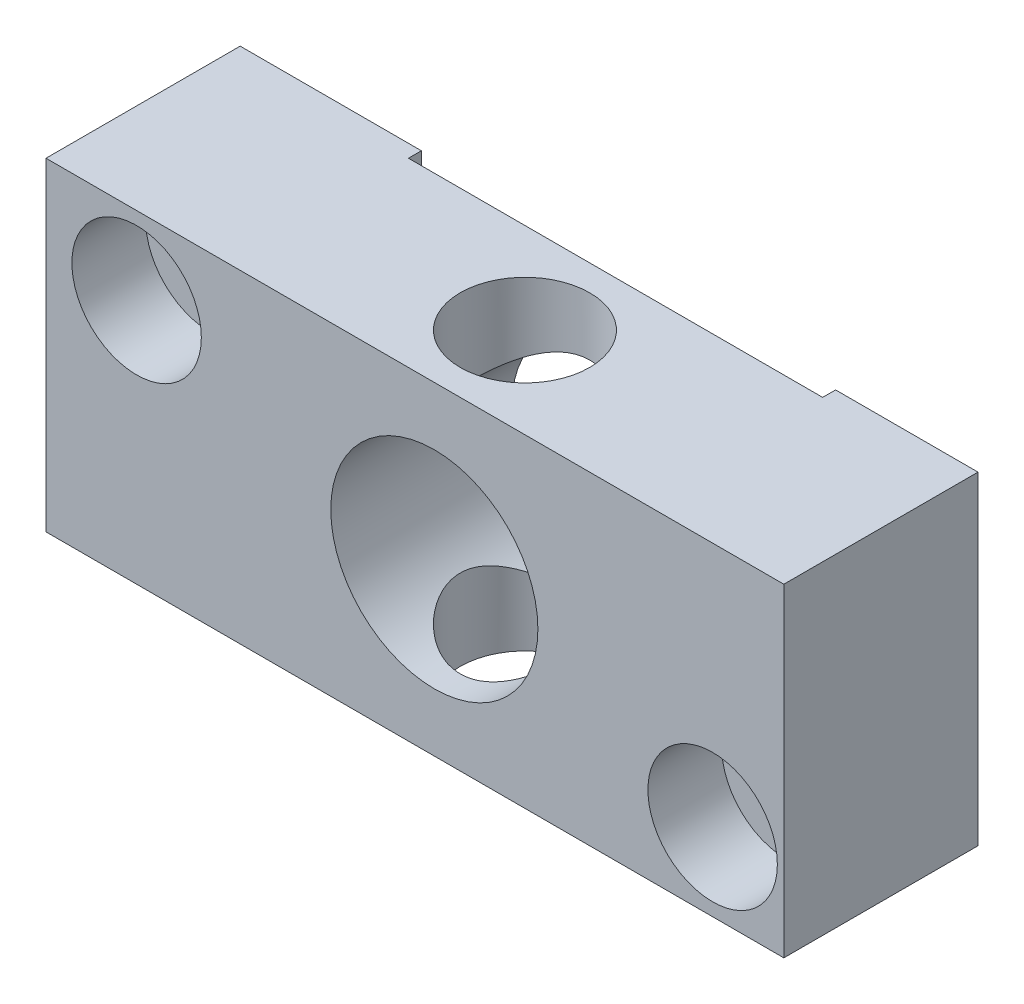
ISO-10303-21;
HEADER;
FILE_DESCRIPTION(('STEP AP214'),'2;1');
FILE_NAME('part.step','',(''),(''),'','','');
FILE_SCHEMA(('AUTOMOTIVE_DESIGN { 1 0 10303 214 1 1 1 1 }'));
ENDSEC;
DATA;
#1=APPLICATION_CONTEXT('core data for automotive mechanical design processes');
#2=APPLICATION_PROTOCOL_DEFINITION('international standard','automotive_design',2000,#1);
#3=PRODUCT_CONTEXT('',#1,'mechanical');
#4=PRODUCT('Part','Part','',(#3));
#5=PRODUCT_RELATED_PRODUCT_CATEGORY('part','',(#4));
#6=PRODUCT_DEFINITION_FORMATION('','',#4);
#7=PRODUCT_DEFINITION_CONTEXT('part definition',#1,'design');
#8=PRODUCT_DEFINITION('design','',#6,#7);
#9=PRODUCT_DEFINITION_SHAPE('','',#8);
#10=(LENGTH_UNIT() NAMED_UNIT(*) SI_UNIT(.MILLI.,.METRE.));
#11=(NAMED_UNIT(*) PLANE_ANGLE_UNIT() SI_UNIT($,.RADIAN.));
#12=(NAMED_UNIT(*) SI_UNIT($,.STERADIAN.) SOLID_ANGLE_UNIT());
#13=UNCERTAINTY_MEASURE_WITH_UNIT(LENGTH_MEASURE(1.E-05),#10,'distance_accuracy_value','');
#14=(GEOMETRIC_REPRESENTATION_CONTEXT(3) GLOBAL_UNCERTAINTY_ASSIGNED_CONTEXT((#13)) GLOBAL_UNIT_ASSIGNED_CONTEXT((#10,
#11,#12)) REPRESENTATION_CONTEXT('',''));
#15=CARTESIAN_POINT('',(0.,0.,0.));
#16=DIRECTION('',(0.,0.,1.));
#17=DIRECTION('',(1.,0.,0.));
#18=AXIS2_PLACEMENT_3D('',#15,#16,#17);
#19=CARTESIAN_POINT('',(23.,6.,-7.5));
#20=DIRECTION('',(0.,0.,1.));
#21=DIRECTION('',(1.,0.,0.));
#22=AXIS2_PLACEMENT_3D('',#19,#20,#21);
#23=CYLINDRICAL_SURFACE('',#22,2.75);
#24=CARTESIAN_POINT('',(23.,6.,-7.5));
#25=DIRECTION('',(0.,0.,1.));
#26=DIRECTION('',(1.,0.,0.));
#27=AXIS2_PLACEMENT_3D('',#24,#25,#26);
#28=CIRCLE('',#27,2.75);
#29=CARTESIAN_POINT('',(25.75,6.,-7.5));
#30=VERTEX_POINT('',#29);
#31=EDGE_CURVE('E222',#30,#30,#28,.T.);
#32=ORIENTED_EDGE('',*,*,#31,.F.);
#33=EDGE_LOOP('',(#32));
#34=FACE_BOUND('',#33,.T.);
#35=CARTESIAN_POINT('',(23.,6.,1.8));
#36=DIRECTION('',(0.,0.,1.));
#37=DIRECTION('',(1.,0.,0.));
#38=AXIS2_PLACEMENT_3D('',#35,#36,#37);
#39=CIRCLE('',#38,2.75);
#40=CARTESIAN_POINT('',(25.75,6.,1.8));
#41=VERTEX_POINT('',#40);
#42=EDGE_CURVE('E43',#41,#41,#39,.F.);
#43=ORIENTED_EDGE('',*,*,#42,.F.);
#44=EDGE_LOOP('',(#43));
#45=FACE_BOUND('',#44,.T.);
#46=ADVANCED_FACE('F39',(#34,#45),#23,.F.);
#47=CARTESIAN_POINT('',(-21.5,19.,-7.5));
#48=DIRECTION('',(0.,0.,1.));
#49=DIRECTION('',(1.,0.,0.));
#50=AXIS2_PLACEMENT_3D('',#47,#48,#49);
#51=CYLINDRICAL_SURFACE('',#50,2.75);
#52=CARTESIAN_POINT('',(-21.5,19.,-7.5));
#53=DIRECTION('',(0.,0.,1.));
#54=DIRECTION('',(1.,0.,0.));
#55=AXIS2_PLACEMENT_3D('',#52,#53,#54);
#56=CIRCLE('',#55,2.75);
#57=CARTESIAN_POINT('',(-18.75,19.,-7.5));
#58=VERTEX_POINT('',#57);
#59=EDGE_CURVE('E195',#58,#58,#56,.T.);
#60=ORIENTED_EDGE('',*,*,#59,.F.);
#61=EDGE_LOOP('',(#60));
#62=FACE_BOUND('',#61,.T.);
#63=CARTESIAN_POINT('',(-21.5,19.,1.8));
#64=DIRECTION('',(0.,0.,1.));
#65=DIRECTION('',(1.,0.,0.));
#66=AXIS2_PLACEMENT_3D('',#63,#64,#65);
#67=CIRCLE('',#66,2.75);
#68=CARTESIAN_POINT('',(-18.75,19.,1.8));
#69=VERTEX_POINT('',#68);
#70=EDGE_CURVE('E227',#69,#69,#67,.F.);
#71=ORIENTED_EDGE('',*,*,#70,.F.);
#72=EDGE_LOOP('',(#71));
#73=FACE_BOUND('',#72,.T.);
#74=ADVANCED_FACE('F209',(#62,#73),#51,.F.);
#75=CARTESIAN_POINT('',(1.5,25.,0.499999999999999));
#76=DIRECTION('',(0.,-1.,0.));
#77=DIRECTION('',(0.,0.,-1.));
#78=AXIS2_PLACEMENT_3D('',#75,#76,#77);
#79=CYLINDRICAL_SURFACE('',#78,5.);
#80=CARTESIAN_POINT('',(1.5,20.5,-4.5));
#81=CARTESIAN_POINT('',(1.37292028180585,20.4999996993204,-4.499999703158));
#82=CARTESIAN_POINT('',(1.24583402364684,20.4969652643807,-4.49514877169044));
#83=CARTESIAN_POINT('',(0.992634318601302,20.4849016334518,-4.47581254301626));
#84=CARTESIAN_POINT('',(0.86652131853697,20.4758698325204,-4.46132305932189));
#85=CARTESIAN_POINT('',(0.616120764419043,20.4520184465362,-4.4228878347618));
#86=CARTESIAN_POINT('',(0.491836036130645,20.4371907155965,-4.39892878436801));
#87=CARTESIAN_POINT('',(0.246119921414285,20.4021008328487,-4.3418697843255));
#88=CARTESIAN_POINT('',(0.124689765762799,20.3818363820478,-4.3087659675088));
#89=CARTESIAN_POINT('',(-0.11383677448202,20.3364650733764,-4.2340323987006));
#90=CARTESIAN_POINT('',(-0.230953116678229,20.3113851166448,-4.19244993505164));
#91=CARTESIAN_POINT('',(-0.460916501646031,20.2568549489875,-4.10110152475158));
#92=CARTESIAN_POINT('',(-0.573761869710929,20.2274030455926,-4.05133240807103));
#93=CARTESIAN_POINT('',(-0.904911909114094,20.1334070824144,-3.89050335799432));
#94=CARTESIAN_POINT('',(-1.11609848167961,20.0631697348111,-3.76783654975881));
#95=CARTESIAN_POINT('',(-1.53193014433839,19.9068029570722,-3.48444604696249));
#96=CARTESIAN_POINT('',(-1.73470598963289,19.8198523352832,-3.32146546344502));
#97=CARTESIAN_POINT('',(-2.11195776992338,19.6412401292643,-2.96710060830363));
#98=CARTESIAN_POINT('',(-2.28639500697958,19.5495723245412,-2.77567816902114));
#99=CARTESIAN_POINT('',(-2.53551059577151,19.4083621712102,-2.45571425020992));
#100=CARTESIAN_POINT('',(-2.62074022592499,19.3577220407582,-2.33571286902764));
#101=CARTESIAN_POINT('',(-2.78074637131475,19.258996468231,-2.08784896365527));
#102=CARTESIAN_POINT('',(-2.85552092872511,19.210911505681,-1.9599849735435));
#103=CARTESIAN_POINT('',(-2.99385262588457,19.1190767795695,-1.69711581232401));
#104=CARTESIAN_POINT('',(-3.05742717693475,19.0753203342642,-1.56212215723772));
#105=CARTESIAN_POINT('',(-3.17278116226384,18.9938515605684,-1.28537755230288));
#106=CARTESIAN_POINT('',(-3.22456056034896,18.9561392507246,-1.14362658172091));
#107=CARTESIAN_POINT('',(-3.30367778250346,18.8973773956048,-0.89186641707947));
#108=CARTESIAN_POINT('',(-3.33387146386473,18.8745432918813,-0.783163945588137));
#109=CARTESIAN_POINT('',(-3.3869893698177,18.8339131311323,-0.563080853126178));
#110=CARTESIAN_POINT('',(-3.40991524122178,18.8161159328931,-0.451700845020765));
#111=CARTESIAN_POINT('',(-3.44817199977536,18.7861900443545,-0.22702366166045));
#112=CARTESIAN_POINT('',(-3.46351189515875,18.7740546317427,-0.113728926331826));
#113=CARTESIAN_POINT('',(-3.48640391146144,18.7558765511001,0.114141290814806));
#114=CARTESIAN_POINT('',(-3.49395573327638,18.749834117073,0.228716821651515));
#115=CARTESIAN_POINT('',(-3.50115324292108,18.744076261913,0.458558653815394));
#116=CARTESIAN_POINT('',(-3.50077951510321,18.744376378463,0.573825959795357));
#117=CARTESIAN_POINT('',(-3.49208386707443,18.7513301416873,0.803905993516058));
#118=CARTESIAN_POINT('',(-3.4837590327066,18.7579861178449,0.918718539089881));
#119=CARTESIAN_POINT('',(-3.45928874246479,18.7773958444386,1.14702108197888));
#120=CARTESIAN_POINT('',(-3.44314081984502,18.7901515181911,1.26051065057156));
#121=CARTESIAN_POINT('',(-3.4032719377126,18.8212780522265,1.48538620317862));
#122=CARTESIAN_POINT('',(-3.37954784440757,18.8396512359911,1.59677129647281));
#123=CARTESIAN_POINT('',(-3.29874186577055,18.9012993406234,1.92161998429045));
#124=CARTESIAN_POINT('',(-3.23140686716691,18.9516270932374,2.13129247784869));
#125=CARTESIAN_POINT('',(-3.07160139234777,19.065824165778,2.53668208845984));
#126=CARTESIAN_POINT('',(-2.97912202607653,19.1296982734005,2.73239423873349));
#127=CARTESIAN_POINT('',(-2.75180409904384,19.2781897280685,3.14331465324919));
#128=CARTESIAN_POINT('',(-2.6122797851601,19.3644530526983,3.35533520228094));
#129=CARTESIAN_POINT('',(-2.30349790123425,19.540239090172,3.75534918374023));
#130=CARTESIAN_POINT('',(-2.13420977102789,19.6297650773476,3.94331757440197));
#131=CARTESIAN_POINT('',(-1.84462792787134,19.768252209276,4.2195685480643));
#132=CARTESIAN_POINT('',(-1.73332743959703,19.8185662821243,4.31674280120393));
#133=CARTESIAN_POINT('',(-1.50184758289934,19.9165140520612,4.50135111278461));
#134=CARTESIAN_POINT('',(-1.38167150233175,19.964148730294,4.5887887482357));
#135=CARTESIAN_POINT('',(-1.13291547069675,20.0554827758688,4.75323322008513));
#136=CARTESIAN_POINT('',(-1.00433330649266,20.099181099596,4.83023729302729));
#137=CARTESIAN_POINT('',(-0.739539435033786,20.1813840545714,4.97292528813083));
#138=CARTESIAN_POINT('',(-0.603332505410607,20.2198918877175,5.03861619614163));
#139=CARTESIAN_POINT('',(-0.331584989370082,20.2887019713349,5.15466886475308));
#140=CARTESIAN_POINT('',(-0.196397920189884,20.3193327980653,5.20566229777452));
#141=CARTESIAN_POINT('',(0.0790248722593712,20.374041131576,5.29602098961896));
#142=CARTESIAN_POINT('',(0.219257660304485,20.3981223807952,5.33539289010581));
#143=CARTESIAN_POINT('',(0.503515497131479,20.4389934527939,5.40186739840658));
#144=CARTESIAN_POINT('',(0.647537010197413,20.4557898346441,5.42898104411324));
#145=CARTESIAN_POINT('',(0.938084638292336,20.4815729924751,5.47049034997301));
#146=CARTESIAN_POINT('',(1.08461032111926,20.4905611025021,5.48488818263482));
#147=CARTESIAN_POINT('',(1.35676196081096,20.4996986702594,5.499520164093));
#148=CARTESIAN_POINT('',(1.48225859214319,20.5009629269789,5.501540864089));
#149=CARTESIAN_POINT('',(1.7329663677664,20.497589451826,5.4961427784958));
#150=CARTESIAN_POINT('',(1.85817753027276,20.4929521077216,5.48872461309248));
#151=CARTESIAN_POINT('',(2.10732783449661,20.4778900552125,5.46455622247317));
#152=CARTESIAN_POINT('',(2.23126708930008,20.4674658659401,5.44780683435154));
#153=CARTESIAN_POINT('',(2.47696969522164,20.4410830021414,5.40520930732267));
#154=CARTESIAN_POINT('',(2.59873300792335,20.425124230003,5.37936100793997));
#155=CARTESIAN_POINT('',(2.83450834578852,20.3887734464902,5.32009055280867));
#156=CARTESIAN_POINT('',(2.94863666980924,20.3685811289848,5.2870073558854));
#157=CARTESIAN_POINT('',(3.17350231741757,20.3238453296492,5.21311096735755));
#158=CARTESIAN_POINT('',(3.28423846943477,20.2993003639589,5.17229513929841));
#159=CARTESIAN_POINT('',(3.61043845304158,20.2198451952159,5.03885022306733));
#160=CARTESIAN_POINT('',(3.82007565393525,20.1590855713638,4.93517728812057));
#161=CARTESIAN_POINT('',(4.24037159603304,20.019594992457,4.6899279363721));
#162=CARTESIAN_POINT('',(4.44899750641244,19.9396690872721,4.54558186341555));
#163=CARTESIAN_POINT('',(4.84056091506499,19.7722803071676,4.22882840333277));
#164=CARTESIAN_POINT('',(5.02346945040511,19.6848091107345,4.05638984261562));
#165=CARTESIAN_POINT('',(5.38590040481163,19.4962341956962,3.65945503308015));
#166=CARTESIAN_POINT('',(5.56107692783136,19.3949947695843,3.43103560865682));
#167=CARTESIAN_POINT('',(5.87121122716532,19.2026710765472,2.9445124155777));
#168=CARTESIAN_POINT('',(6.00619684735976,19.1115798065832,2.68642937021098));
#169=CARTESIAN_POINT('',(6.20739703071134,18.9693398897321,2.20118604230814));
#170=CARTESIAN_POINT('',(6.28209607779641,18.9138210649208,1.97888427189796));
#171=CARTESIAN_POINT('',(6.37056932795046,18.8465659674355,1.63643451168062));
#172=CARTESIAN_POINT('',(6.39612834571372,18.8268205490864,1.52080987665685));
#173=CARTESIAN_POINT('',(6.43906627660446,18.7933595900355,1.287213009902));
#174=CARTESIAN_POINT('',(6.45644870968554,18.7796414548051,1.16924181118659));
#175=CARTESIAN_POINT('',(6.48283345322303,18.7587264656777,0.931062976531055));
#176=CARTESIAN_POINT('',(6.49178464992502,18.7515693946567,0.81084614919437));
#177=CARTESIAN_POINT('',(6.50096567028373,18.7442275405776,0.569865077298083));
#178=CARTESIAN_POINT('',(6.50119553239924,18.7440427267736,0.449100835154787));
#179=CARTESIAN_POINT('',(6.49292458618068,18.7506586724771,0.208024474188881));
#180=CARTESIAN_POINT('',(6.48442112542226,18.7574615542391,0.0877125038687355));
#181=CARTESIAN_POINT('',(6.45884706925013,18.777745568762,-0.15139366298223));
#182=CARTESIAN_POINT('',(6.44177659470705,18.7912266073017,-0.27018788090253));
#183=CARTESIAN_POINT('',(6.38153513763474,18.8382277398026,-0.603971389978071));
#184=CARTESIAN_POINT('',(6.32847742875035,18.8790757644623,-0.816237760025109));
#185=CARTESIAN_POINT('',(6.19670428935884,18.9766977700412,-1.228579701154));
#186=CARTESIAN_POINT('',(6.11797815957074,19.0334783907125,-1.42865014730156));
#187=CARTESIAN_POINT('',(5.92410573147435,19.166557931333,-1.84237556307302));
#188=CARTESIAN_POINT('',(5.80533683658203,19.2444924914292,-2.05380395596853));
#189=CARTESIAN_POINT('',(5.54000963034607,19.4067049823514,-2.45575070468091));
#190=CARTESIAN_POINT('',(5.39342885237777,19.4909880080871,-2.64625195760183));
#191=CARTESIAN_POINT('',(5.04264024371938,19.676089947826,-3.0400839692072));
#192=CARTESIAN_POINT('',(4.83276887019885,19.7768764036445,-3.23847789009049));
#193=CARTESIAN_POINT('',(4.49268031590093,19.920183590463,-3.50810023016021));
#194=CARTESIAN_POINT('',(4.37498419390475,19.9666796252241,-3.59337831825354));
#195=CARTESIAN_POINT('',(4.13162062416604,20.0558801905472,-3.75391486002553));
#196=CARTESIAN_POINT('',(4.00595739502895,20.0985866993974,-3.82917855200336));
#197=CARTESIAN_POINT('',(3.74695585117552,20.1791688889058,-3.96910627052635));
#198=CARTESIAN_POINT('',(3.61359966396132,20.2170326040972,-4.03374415122623));
#199=CARTESIAN_POINT('',(3.34039127350629,20.2867074506604,-4.15135006079646));
#200=CARTESIAN_POINT('',(3.20054287903652,20.318522076379,-4.20432482984781));
#201=CARTESIAN_POINT('',(2.91574969186899,20.3750664478824,-4.29771288731285));
#202=CARTESIAN_POINT('',(2.7708198159225,20.3998152526367,-4.33815999270725));
#203=CARTESIAN_POINT('',(2.47691245346488,20.4415135957936,-4.4059510328588));
#204=CARTESIAN_POINT('',(2.32793803832141,20.4584688862218,-4.43330463193524));
#205=CARTESIAN_POINT('',(2.0657080346281,20.4807660577289,-4.46918150103186));
#206=CARTESIAN_POINT('',(1.95301204396112,20.4879654221781,-4.48072550400174));
#207=CARTESIAN_POINT('',(1.72687913634895,20.4975826754943,-4.49613512360569));
#208=CARTESIAN_POINT('',(1.61344217398009,20.5000002684122,-4.50000026498644));
#209=CARTESIAN_POINT('',(1.5,20.5,-4.5));
#210=B_SPLINE_CURVE_WITH_KNOTS('',3,(#80,#81,#82,#83,#84,#85,#86,#87,#88,#89,#90,#91,#92,#93,
#94,#95,#96,#97,#98,#99,#100,#101,#102,#103,#104,#105,#106,#107,#108,#109,#110,#111,#112,#113,
#114,#115,#116,#117,#118,#119,#120,#121,#122,#123,#124,#125,#126,#127,#128,#129,#130,#131,#132,
#133,#134,#135,#136,#137,#138,#139,#140,#141,#142,#143,#144,#145,#146,#147,#148,#149,#150,#151,
#152,#153,#154,#155,#156,#157,#158,#159,#160,#161,#162,#163,#164,#165,#166,#167,#168,#169,#170,
#171,#172,#173,#174,#175,#176,#177,#178,#179,#180,#181,#182,#183,#184,#185,#186,#187,#188,#189,
#190,#191,#192,#193,#194,#195,#196,#197,#198,#199,#200,#201,#202,#203,#204,#205,#206,#207,#208,
#209),.UNSPECIFIED.,.T.,.F.,(4,2,2,2,2,2,2,2,2,2,2,2,2,2,2,2,2,2,2,2,2,2,2,2,2,2,2,2,2,2,2,2,2,
2,2,2,2,2,2,2,2,2,2,2,2,2,2,2,2,2,2,2,2,2,2,2,2,2,2,2,2,2,2,2,4),(0.,0.381122813878229,
0.762411275945245,1.14423755771083,1.52622555522555,1.90613865065076,2.2861992035346,
3.04547146930923,3.86537873527685,4.68639638614618,5.15288943324734,5.61946971957746,
6.08531814323784,6.55116799634915,6.89615022205285,7.24105422230075,7.58554766475416,
7.9300543371358,8.27540506342305,8.62088241265912,8.96646876744119,9.31219825544432,
9.98712845371039,10.6622975916544,11.463592889512,12.2657157783383,12.7334704505957,
13.2010527095967,13.6687585723722,14.1361745843372,14.5786070973028,15.0207862699487,
15.4625664873666,15.9042712116065,16.280349331717,16.6564027426817,17.0324224237136,
17.4084487368524,17.7696430642803,18.1309607639224,18.8530325398091,19.6479898222925,
20.4438353357779,21.355208937219,22.2659496705469,22.9857781952855,23.3455439181714,
23.705154622762,24.0669316687913,24.4287071194786,24.7905924786018,25.1524727320855,
25.8172983911075,26.482401522191,27.2437925511324,28.0058012758041,28.9187931910577,
29.3761295657642,29.8332257699805,30.2914303932663,30.7493695182481,31.2060614935589,
31.6624158626754,32.0026174741983,32.3428401405226),.UNSPECIFIED.);
#211=CARTESIAN_POINT('',(1.5,20.5,-4.5));
#212=VERTEX_POINT('',#211);
#213=EDGE_CURVE('E194',#212,#212,#210,.T.);
#214=ORIENTED_EDGE('',*,*,#213,.F.);
#215=EDGE_LOOP('',(#214));
#216=FACE_BOUND('',#215,.T.);
#217=CARTESIAN_POINT('',(1.5,25.,0.499999999999999));
#218=DIRECTION('',(0.,1.,0.));
#219=DIRECTION('',(0.,0.,1.));
#220=AXIS2_PLACEMENT_3D('',#217,#218,#219);
#221=CIRCLE('',#220,5.);
#222=CARTESIAN_POINT('',(1.5,25.,5.5));
#223=VERTEX_POINT('',#222);
#224=EDGE_CURVE('E149',#223,#223,#221,.T.);
#225=ORIENTED_EDGE('',*,*,#224,.T.);
#226=EDGE_LOOP('',(#225));
#227=FACE_BOUND('',#226,.T.);
#228=ADVANCED_FACE('F217',(#216,#227),#79,.F.);
#229=CARTESIAN_POINT('',(0.,25.,0.));
#230=DIRECTION('',(0.,1.,0.));
#231=DIRECTION('',(0.,0.,1.));
#232=AXIS2_PLACEMENT_3D('',#229,#230,#231);
#233=PLANE('',#232);
#234=DIRECTION('',(-1.,0.,0.));
#235=VECTOR('',#234,1.);
#236=CARTESIAN_POINT('',(17.5,25.,-7.5));
#237=LINE('',#236,#235);
#238=CARTESIAN_POINT('',(28.5,25.,-7.5));
#239=VERTEX_POINT('',#238);
#240=CARTESIAN_POINT('',(17.5,25.,-7.5));
#241=VERTEX_POINT('',#240);
#242=EDGE_CURVE('E167',#239,#241,#237,.T.);
#243=ORIENTED_EDGE('',*,*,#242,.T.);
#244=DIRECTION('',(0.,0.,1.));
#245=VECTOR('',#244,1.);
#246=CARTESIAN_POINT('',(17.5,25.,-6.5));
#247=LINE('',#246,#245);
#248=CARTESIAN_POINT('',(17.5,25.,-6.5));
#249=VERTEX_POINT('',#248);
#250=EDGE_CURVE('E102',#241,#249,#247,.T.);
#251=ORIENTED_EDGE('',*,*,#250,.T.);
#252=DIRECTION('',(-1.,0.,0.));
#253=VECTOR('',#252,1.);
#254=CARTESIAN_POINT('',(-14.5,25.,-6.5));
#255=LINE('',#254,#253);
#256=CARTESIAN_POINT('',(-14.5,25.,-6.5));
#257=VERTEX_POINT('',#256);
#258=EDGE_CURVE('E275',#249,#257,#255,.T.);
#259=ORIENTED_EDGE('',*,*,#258,.T.);
#260=DIRECTION('',(0.,0.,-1.));
#261=VECTOR('',#260,1.);
#262=CARTESIAN_POINT('',(-14.5,25.,-7.5));
#263=LINE('',#262,#261);
#264=CARTESIAN_POINT('',(-14.5,25.,-7.5));
#265=VERTEX_POINT('',#264);
#266=EDGE_CURVE('E278',#257,#265,#263,.T.);
#267=ORIENTED_EDGE('',*,*,#266,.T.);
#268=DIRECTION('',(-1.,0.,0.));
#269=VECTOR('',#268,1.);
#270=CARTESIAN_POINT('',(-28.5,25.,-7.5));
#271=LINE('',#270,#269);
#272=CARTESIAN_POINT('',(-28.5,25.,-7.5));
#273=VERTEX_POINT('',#272);
#274=EDGE_CURVE('E122',#265,#273,#271,.T.);
#275=ORIENTED_EDGE('',*,*,#274,.T.);
#276=DIRECTION('',(0.,0.,1.));
#277=VECTOR('',#276,1.);
#278=CARTESIAN_POINT('',(-28.5,25.,7.5));
#279=LINE('',#278,#277);
#280=CARTESIAN_POINT('',(-28.5,25.,7.5));
#281=VERTEX_POINT('',#280);
#282=EDGE_CURVE('E115',#273,#281,#279,.T.);
#283=ORIENTED_EDGE('',*,*,#282,.T.);
#284=DIRECTION('',(1.,0.,0.));
#285=VECTOR('',#284,1.);
#286=CARTESIAN_POINT('',(-28.5,25.,7.5));
#287=LINE('',#286,#285);
#288=CARTESIAN_POINT('',(28.5,25.,7.5));
#289=VERTEX_POINT('',#288);
#290=EDGE_CURVE('E120',#281,#289,#287,.T.);
#291=ORIENTED_EDGE('',*,*,#290,.T.);
#292=DIRECTION('',(0.,0.,-1.));
#293=VECTOR('',#292,1.);
#294=CARTESIAN_POINT('',(28.5,25.,7.5));
#295=LINE('',#294,#293);
#296=EDGE_CURVE('E59',#289,#239,#295,.T.);
#297=ORIENTED_EDGE('',*,*,#296,.T.);
#298=EDGE_LOOP('',(#243,#251,#259,#267,#275,#283,#291,#297));
#299=FACE_BOUND('',#298,.T.);
#300=ORIENTED_EDGE('',*,*,#224,.F.);
#301=EDGE_LOOP('',(#300));
#302=FACE_BOUND('',#301,.T.);
#303=ADVANCED_FACE('F117',(#299,#302),#233,.T.);
#304=CARTESIAN_POINT('',(0.,0.,0.));
#305=DIRECTION('',(0.,1.,0.));
#306=DIRECTION('',(0.,0.,1.));
#307=AXIS2_PLACEMENT_3D('',#304,#305,#306);
#308=PLANE('',#307);
#309=DIRECTION('',(-1.,0.,0.));
#310=VECTOR('',#309,1.);
#311=CARTESIAN_POINT('',(17.5,0.,-7.5));
#312=LINE('',#311,#310);
#313=CARTESIAN_POINT('',(28.5,0.,-7.5));
#314=VERTEX_POINT('',#313);
#315=CARTESIAN_POINT('',(17.5,0.,-7.5));
#316=VERTEX_POINT('',#315);
#317=EDGE_CURVE('E144',#314,#316,#312,.T.);
#318=ORIENTED_EDGE('',*,*,#317,.F.);
#319=DIRECTION('',(0.,0.,-1.));
#320=VECTOR('',#319,1.);
#321=CARTESIAN_POINT('',(28.5,0.,7.5));
#322=LINE('',#321,#320);
#323=CARTESIAN_POINT('',(28.5,0.,7.5));
#324=VERTEX_POINT('',#323);
#325=EDGE_CURVE('E94',#324,#314,#322,.T.);
#326=ORIENTED_EDGE('',*,*,#325,.F.);
#327=DIRECTION('',(1.,0.,0.));
#328=VECTOR('',#327,1.);
#329=CARTESIAN_POINT('',(-28.5,0.,7.5));
#330=LINE('',#329,#328);
#331=CARTESIAN_POINT('',(-28.5,0.,7.5));
#332=VERTEX_POINT('',#331);
#333=EDGE_CURVE('E88',#332,#324,#330,.T.);
#334=ORIENTED_EDGE('',*,*,#333,.F.);
#335=DIRECTION('',(0.,0.,1.));
#336=VECTOR('',#335,1.);
#337=CARTESIAN_POINT('',(-28.5,0.,7.5));
#338=LINE('',#337,#336);
#339=CARTESIAN_POINT('',(-28.5,0.,-7.5));
#340=VERTEX_POINT('',#339);
#341=EDGE_CURVE('E131',#340,#332,#338,.T.);
#342=ORIENTED_EDGE('',*,*,#341,.F.);
#343=DIRECTION('',(-1.,0.,0.));
#344=VECTOR('',#343,1.);
#345=CARTESIAN_POINT('',(-28.5,0.,-7.5));
#346=LINE('',#345,#344);
#347=CARTESIAN_POINT('',(-14.5,0.,-7.5));
#348=VERTEX_POINT('',#347);
#349=EDGE_CURVE('E158',#348,#340,#346,.T.);
#350=ORIENTED_EDGE('',*,*,#349,.F.);
#351=DIRECTION('',(0.,0.,-1.));
#352=VECTOR('',#351,1.);
#353=CARTESIAN_POINT('',(-14.5,0.,-7.5));
#354=LINE('',#353,#352);
#355=CARTESIAN_POINT('',(-14.5,0.,-6.5));
#356=VERTEX_POINT('',#355);
#357=EDGE_CURVE('E155',#356,#348,#354,.T.);
#358=ORIENTED_EDGE('',*,*,#357,.F.);
#359=DIRECTION('',(-1.,0.,0.));
#360=VECTOR('',#359,1.);
#361=CARTESIAN_POINT('',(-14.5,0.,-6.5));
#362=LINE('',#361,#360);
#363=CARTESIAN_POINT('',(17.5,0.,-6.5));
#364=VERTEX_POINT('',#363);
#365=EDGE_CURVE('E152',#364,#356,#362,.T.);
#366=ORIENTED_EDGE('',*,*,#365,.F.);
#367=DIRECTION('',(0.,0.,1.));
#368=VECTOR('',#367,1.);
#369=CARTESIAN_POINT('',(17.5,0.,-6.5));
#370=LINE('',#369,#368);
#371=EDGE_CURVE('E148',#316,#364,#370,.T.);
#372=ORIENTED_EDGE('',*,*,#371,.F.);
#373=EDGE_LOOP('',(#318,#326,#334,#342,#350,#358,#366,#372));
#374=FACE_BOUND('',#373,.T.);
#375=CARTESIAN_POINT('',(1.5,0.,0.499999999999999));
#376=DIRECTION('',(0.,1.,0.));
#377=DIRECTION('',(0.,0.,1.));
#378=AXIS2_PLACEMENT_3D('',#375,#376,#377);
#379=CIRCLE('',#378,5.);
#380=CARTESIAN_POINT('',(1.5,0.,5.5));
#381=VERTEX_POINT('',#380);
#382=EDGE_CURVE('E264',#381,#381,#379,.T.);
#383=ORIENTED_EDGE('',*,*,#382,.T.);
#384=EDGE_LOOP('',(#383));
#385=FACE_BOUND('',#384,.T.);
#386=ADVANCED_FACE('F291',(#374,#385),#308,.F.);
#387=CARTESIAN_POINT('',(17.5,25.,-7.5));
#388=DIRECTION('',(0.,0.,1.));
#389=DIRECTION('',(1.,0.,0.));
#390=AXIS2_PLACEMENT_3D('',#387,#388,#389);
#391=PLANE('',#390);
#392=ORIENTED_EDGE('',*,*,#31,.T.);
#393=EDGE_LOOP('',(#392));
#394=FACE_BOUND('',#393,.T.);
#395=ORIENTED_EDGE('',*,*,#317,.T.);
#396=DIRECTION('',(0.,-1.,0.));
#397=VECTOR('',#396,1.);
#398=CARTESIAN_POINT('',(17.5,25.,-7.5));
#399=LINE('',#398,#397);
#400=EDGE_CURVE('E11',#241,#316,#399,.T.);
#401=ORIENTED_EDGE('',*,*,#400,.F.);
#402=ORIENTED_EDGE('',*,*,#242,.F.);
#403=DIRECTION('',(0.,-1.,0.));
#404=VECTOR('',#403,1.);
#405=CARTESIAN_POINT('',(28.5,25.,-7.5));
#406=LINE('',#405,#404);
#407=EDGE_CURVE('E140',#239,#314,#406,.T.);
#408=ORIENTED_EDGE('',*,*,#407,.T.);
#409=EDGE_LOOP('',(#395,#401,#402,#408));
#410=FACE_BOUND('',#409,.T.);
#411=ADVANCED_FACE('F41',(#394,#410),#391,.F.);
#412=CARTESIAN_POINT('',(17.5,25.,-6.5));
#413=DIRECTION('',(1.,0.,0.));
#414=DIRECTION('',(0.,0.,-1.));
#415=AXIS2_PLACEMENT_3D('',#412,#413,#414);
#416=PLANE('',#415);
#417=ORIENTED_EDGE('',*,*,#371,.T.);
#418=DIRECTION('',(0.,-1.,0.));
#419=VECTOR('',#418,1.);
#420=CARTESIAN_POINT('',(17.5,25.,-6.5));
#421=LINE('',#420,#419);
#422=EDGE_CURVE('E50',#249,#364,#421,.T.);
#423=ORIENTED_EDGE('',*,*,#422,.F.);
#424=ORIENTED_EDGE('',*,*,#250,.F.);
#425=ORIENTED_EDGE('',*,*,#400,.T.);
#426=EDGE_LOOP('',(#417,#423,#424,#425));
#427=FACE_BOUND('',#426,.T.);
#428=ADVANCED_FACE('F316',(#427),#416,.F.);
#429=CARTESIAN_POINT('',(-14.5,25.,-6.5));
#430=DIRECTION('',(0.,0.,1.));
#431=DIRECTION('',(1.,0.,0.));
#432=AXIS2_PLACEMENT_3D('',#429,#430,#431);
#433=PLANE('',#432);
#434=CARTESIAN_POINT('',(1.5,12.5,-6.5));
#435=DIRECTION('',(0.,0.,1.));
#436=DIRECTION('',(1.,0.,0.));
#437=AXIS2_PLACEMENT_3D('',#434,#435,#436);
#438=CIRCLE('',#437,8.);
#439=CARTESIAN_POINT('',(9.5,12.5,-6.5));
#440=VERTEX_POINT('',#439);
#441=EDGE_CURVE('E260',#440,#440,#438,.T.);
#442=ORIENTED_EDGE('',*,*,#441,.T.);
#443=EDGE_LOOP('',(#442));
#444=FACE_BOUND('',#443,.T.);
#445=ORIENTED_EDGE('',*,*,#365,.T.);
#446=DIRECTION('',(0.,-1.,0.));
#447=VECTOR('',#446,1.);
#448=CARTESIAN_POINT('',(-14.5,25.,-6.5));
#449=LINE('',#448,#447);
#450=EDGE_CURVE('E178',#257,#356,#449,.T.);
#451=ORIENTED_EDGE('',*,*,#450,.F.);
#452=ORIENTED_EDGE('',*,*,#258,.F.);
#453=ORIENTED_EDGE('',*,*,#422,.T.);
#454=EDGE_LOOP('',(#445,#451,#452,#453));
#455=FACE_BOUND('',#454,.T.);
#456=ADVANCED_FACE('F313',(#444,#455),#433,.F.);
#457=CARTESIAN_POINT('',(-14.5,25.,-7.5));
#458=DIRECTION('',(-1.,0.,0.));
#459=DIRECTION('',(0.,0.,1.));
#460=AXIS2_PLACEMENT_3D('',#457,#458,#459);
#461=PLANE('',#460);
#462=ORIENTED_EDGE('',*,*,#357,.T.);
#463=DIRECTION('',(0.,-1.,0.));
#464=VECTOR('',#463,1.);
#465=CARTESIAN_POINT('',(-14.5,25.,-7.5));
#466=LINE('',#465,#464);
#467=EDGE_CURVE('E174',#265,#348,#466,.T.);
#468=ORIENTED_EDGE('',*,*,#467,.F.);
#469=ORIENTED_EDGE('',*,*,#266,.F.);
#470=ORIENTED_EDGE('',*,*,#450,.T.);
#471=EDGE_LOOP('',(#462,#468,#469,#470));
#472=FACE_BOUND('',#471,.T.);
#473=ADVANCED_FACE('F309',(#472),#461,.F.);
#474=CARTESIAN_POINT('',(-28.5,25.,-7.5));
#475=DIRECTION('',(0.,0.,1.));
#476=DIRECTION('',(1.,0.,0.));
#477=AXIS2_PLACEMENT_3D('',#474,#475,#476);
#478=PLANE('',#477);
#479=ORIENTED_EDGE('',*,*,#59,.T.);
#480=EDGE_LOOP('',(#479));
#481=FACE_BOUND('',#480,.T.);
#482=ORIENTED_EDGE('',*,*,#349,.T.);
#483=DIRECTION('',(0.,-1.,0.));
#484=VECTOR('',#483,1.);
#485=CARTESIAN_POINT('',(-28.5,25.,-7.5));
#486=LINE('',#485,#484);
#487=EDGE_CURVE('E133',#273,#340,#486,.T.);
#488=ORIENTED_EDGE('',*,*,#487,.F.);
#489=ORIENTED_EDGE('',*,*,#274,.F.);
#490=ORIENTED_EDGE('',*,*,#467,.T.);
#491=EDGE_LOOP('',(#482,#488,#489,#490));
#492=FACE_BOUND('',#491,.T.);
#493=ADVANCED_FACE('F306',(#481,#492),#478,.F.);
#494=CARTESIAN_POINT('',(-28.5,25.,7.5));
#495=DIRECTION('',(1.,0.,0.));
#496=DIRECTION('',(0.,0.,-1.));
#497=AXIS2_PLACEMENT_3D('',#494,#495,#496);
#498=PLANE('',#497);
#499=ORIENTED_EDGE('',*,*,#341,.T.);
#500=DIRECTION('',(0.,-1.,0.));
#501=VECTOR('',#500,1.);
#502=CARTESIAN_POINT('',(-28.5,25.,7.5));
#503=LINE('',#502,#501);
#504=EDGE_CURVE('E128',#281,#332,#503,.T.);
#505=ORIENTED_EDGE('',*,*,#504,.F.);
#506=ORIENTED_EDGE('',*,*,#282,.F.);
#507=ORIENTED_EDGE('',*,*,#487,.T.);
#508=EDGE_LOOP('',(#499,#505,#506,#507));
#509=FACE_BOUND('',#508,.T.);
#510=ADVANCED_FACE('F129',(#509),#498,.F.);
#511=CARTESIAN_POINT('',(-28.5,25.,7.5));
#512=DIRECTION('',(0.,0.,-1.));
#513=DIRECTION('',(-1.,0.,0.));
#514=AXIS2_PLACEMENT_3D('',#511,#512,#513);
#515=PLANE('',#514);
#516=CARTESIAN_POINT('',(-21.5,19.,7.5));
#517=DIRECTION('',(0.,0.,1.));
#518=DIRECTION('',(1.,0.,0.));
#519=AXIS2_PLACEMENT_3D('',#516,#517,#518);
#520=CIRCLE('',#519,5.);
#521=CARTESIAN_POINT('',(-16.5,19.,7.5));
#522=VERTEX_POINT('',#521);
#523=EDGE_CURVE('E238',#522,#522,#520,.T.);
#524=ORIENTED_EDGE('',*,*,#523,.F.);
#525=EDGE_LOOP('',(#524));
#526=FACE_BOUND('',#525,.T.);
#527=CARTESIAN_POINT('',(23.,6.,7.5));
#528=DIRECTION('',(0.,0.,1.));
#529=DIRECTION('',(1.,0.,0.));
#530=AXIS2_PLACEMENT_3D('',#527,#528,#529);
#531=CIRCLE('',#530,5.);
#532=CARTESIAN_POINT('',(28.,6.,7.5));
#533=VERTEX_POINT('',#532);
#534=EDGE_CURVE('E250',#533,#533,#531,.T.);
#535=ORIENTED_EDGE('',*,*,#534,.F.);
#536=EDGE_LOOP('',(#535));
#537=FACE_BOUND('',#536,.T.);
#538=CARTESIAN_POINT('',(1.5,12.5,7.5));
#539=DIRECTION('',(0.,0.,1.));
#540=DIRECTION('',(1.,0.,0.));
#541=AXIS2_PLACEMENT_3D('',#538,#539,#540);
#542=CIRCLE('',#541,8.);
#543=CARTESIAN_POINT('',(9.5,12.5,7.5));
#544=VERTEX_POINT('',#543);
#545=EDGE_CURVE('E230',#544,#544,#542,.T.);
#546=ORIENTED_EDGE('',*,*,#545,.F.);
#547=EDGE_LOOP('',(#546));
#548=FACE_BOUND('',#547,.T.);
#549=ORIENTED_EDGE('',*,*,#333,.T.);
#550=DIRECTION('',(0.,-1.,0.));
#551=VECTOR('',#550,1.);
#552=CARTESIAN_POINT('',(28.5,25.,7.5));
#553=LINE('',#552,#551);
#554=EDGE_CURVE('E134',#289,#324,#553,.T.);
#555=ORIENTED_EDGE('',*,*,#554,.F.);
#556=ORIENTED_EDGE('',*,*,#290,.F.);
#557=ORIENTED_EDGE('',*,*,#504,.T.);
#558=EDGE_LOOP('',(#549,#555,#556,#557));
#559=FACE_BOUND('',#558,.T.);
#560=ADVANCED_FACE('F136',(#526,#537,#548,#559),#515,.F.);
#561=CARTESIAN_POINT('',(28.5,25.,7.5));
#562=DIRECTION('',(-1.,0.,0.));
#563=DIRECTION('',(0.,0.,1.));
#564=AXIS2_PLACEMENT_3D('',#561,#562,#563);
#565=PLANE('',#564);
#566=ORIENTED_EDGE('',*,*,#325,.T.);
#567=ORIENTED_EDGE('',*,*,#407,.F.);
#568=ORIENTED_EDGE('',*,*,#296,.F.);
#569=ORIENTED_EDGE('',*,*,#554,.T.);
#570=EDGE_LOOP('',(#566,#567,#568,#569));
#571=FACE_BOUND('',#570,.T.);
#572=ADVANCED_FACE('F298',(#571),#565,.F.);
#573=CARTESIAN_POINT('',(1.5,4.5,-4.5));
#574=CARTESIAN_POINT('',(1.62707971819414,4.50000030067962,-4.499999703158));
#575=CARTESIAN_POINT('',(1.75416597635316,4.50303473561928,-4.49514877169044));
#576=CARTESIAN_POINT('',(2.00736568139869,4.51509836654825,-4.47581254301626));
#577=CARTESIAN_POINT('',(2.13347868146303,4.52413016747961,-4.46132305932189));
#578=CARTESIAN_POINT('',(2.38387923558095,4.54798155346382,-4.4228878347618));
#579=CARTESIAN_POINT('',(2.50816396386935,4.56280928440354,-4.39892878436801));
#580=CARTESIAN_POINT('',(2.75388007858571,4.59789916715132,-4.3418697843255));
#581=CARTESIAN_POINT('',(2.8753102342372,4.61816361795216,-4.3087659675088));
#582=CARTESIAN_POINT('',(3.11383677448202,4.66353492662364,-4.2340323987006));
#583=CARTESIAN_POINT('',(3.23095311667823,4.68861488335517,-4.19244993505164));
#584=CARTESIAN_POINT('',(3.46091650164603,4.74314505101251,-4.10110152475158));
#585=CARTESIAN_POINT('',(3.57376186971092,4.77259695440739,-4.05133240807103));
#586=CARTESIAN_POINT('',(3.90491190911409,4.86659291758563,-3.89050335799432));
#587=CARTESIAN_POINT('',(4.11609848167961,4.93683026518889,-3.76783654975881));
#588=CARTESIAN_POINT('',(4.53193014433838,5.09319704292776,-3.48444604696249));
#589=CARTESIAN_POINT('',(4.73470598963289,5.18014766471677,-3.32146546344502));
#590=CARTESIAN_POINT('',(5.11195776992338,5.3587598707357,-2.96710060830363));
#591=CARTESIAN_POINT('',(5.28639500697958,5.45042767545878,-2.77567816902114));
#592=CARTESIAN_POINT('',(5.5355105957715,5.59163782878981,-2.45571425020992));
#593=CARTESIAN_POINT('',(5.62074022592498,5.64227795924176,-2.33571286902764));
#594=CARTESIAN_POINT('',(5.78074637131474,5.74100353176899,-2.08784896365527));
#595=CARTESIAN_POINT('',(5.85552092872511,5.78908849431897,-1.9599849735435));
#596=CARTESIAN_POINT('',(5.99385262588457,5.88092322043047,-1.69711581232401));
#597=CARTESIAN_POINT('',(6.05742717693474,5.92467966573576,-1.56212215723772));
#598=CARTESIAN_POINT('',(6.17278116226383,6.00614843943157,-1.28537755230288));
#599=CARTESIAN_POINT('',(6.22456056034896,6.04386074927537,-1.14362658172091));
#600=CARTESIAN_POINT('',(6.30367778250345,6.10262260439521,-0.891866417079468));
#601=CARTESIAN_POINT('',(6.33387146386472,6.12545670811872,-0.783163945588136));
#602=CARTESIAN_POINT('',(6.3869893698177,6.16608686886767,-0.563080853126177));
#603=CARTESIAN_POINT('',(6.40991524122178,6.18388406710691,-0.451700845020764));
#604=CARTESIAN_POINT('',(6.44817199977536,6.21380995564549,-0.227023661660449));
#605=CARTESIAN_POINT('',(6.46351189515874,6.22594536825733,-0.113728926331825));
#606=CARTESIAN_POINT('',(6.48640391146144,6.24412344889993,0.114141290814808));
#607=CARTESIAN_POINT('',(6.49395573327638,6.25016588292699,0.228716821651517));
#608=CARTESIAN_POINT('',(6.50115324292108,6.25592373808703,0.458558653815396));
#609=CARTESIAN_POINT('',(6.50077951510321,6.25562362153698,0.573825959795358));
#610=CARTESIAN_POINT('',(6.49208386707442,6.2486698583127,0.80390599351606));
#611=CARTESIAN_POINT('',(6.48375903270659,6.24201388215507,0.918718539089884));
#612=CARTESIAN_POINT('',(6.45928874246478,6.22260415556144,1.14702108197888));
#613=CARTESIAN_POINT('',(6.44314081984502,6.20984848180893,1.26051065057156));
#614=CARTESIAN_POINT('',(6.40327193771259,6.17872194777349,1.48538620317863));
#615=CARTESIAN_POINT('',(6.37954784440757,6.16034876400893,1.59677129647281));
#616=CARTESIAN_POINT('',(6.29874186577055,6.09870065937659,1.92161998429045));
#617=CARTESIAN_POINT('',(6.23140686716691,6.04837290676259,2.13129247784869));
#618=CARTESIAN_POINT('',(6.07160139234776,5.934175834222,2.53668208845984));
#619=CARTESIAN_POINT('',(5.97912202607652,5.87030172659953,2.73239423873349));
#620=CARTESIAN_POINT('',(5.75180409904384,5.72181027193155,3.14331465324919));
#621=CARTESIAN_POINT('',(5.61227978516009,5.63554694730166,3.35533520228095));
#622=CARTESIAN_POINT('',(5.30349790123425,5.45976090982799,3.75534918374023));
#623=CARTESIAN_POINT('',(5.13420977102789,5.37023492265238,3.94331757440197));
#624=CARTESIAN_POINT('',(4.84462792787133,5.23174779072398,4.2195685480643));
#625=CARTESIAN_POINT('',(4.73332743959703,5.18143371787568,4.31674280120393));
#626=CARTESIAN_POINT('',(4.50184758289934,5.0834859479388,4.50135111278461));
#627=CARTESIAN_POINT('',(4.38167150233174,5.03585126970599,4.5887887482357));
#628=CARTESIAN_POINT('',(4.13291547069674,4.94451722413124,4.75323322008513));
#629=CARTESIAN_POINT('',(4.00433330649265,4.90081890040397,4.83023729302729));
#630=CARTESIAN_POINT('',(3.73953943503378,4.81861594542864,4.97292528813083));
#631=CARTESIAN_POINT('',(3.6033325054106,4.78010811228252,5.03861619614163));
#632=CARTESIAN_POINT('',(3.33158498937008,4.71129802866511,5.15466886475308));
#633=CARTESIAN_POINT('',(3.19639792018988,4.68066720193467,5.20566229777452));
#634=CARTESIAN_POINT('',(2.92097512774062,4.62595886842404,5.29602098961896));
#635=CARTESIAN_POINT('',(2.78074233969551,4.60187761920479,5.33539289010582));
#636=CARTESIAN_POINT('',(2.49648450286852,4.56100654720609,5.40186739840658));
#637=CARTESIAN_POINT('',(2.35246298980258,4.54421016535586,5.42898104411324));
#638=CARTESIAN_POINT('',(2.06191536170766,4.51842700752492,5.47049034997301));
#639=CARTESIAN_POINT('',(1.91538967888074,4.50943889749787,5.48488818263482));
#640=CARTESIAN_POINT('',(1.64323803918903,4.50030132974061,5.499520164093));
#641=CARTESIAN_POINT('',(1.51774140785681,4.49903707302109,5.501540864089));
#642=CARTESIAN_POINT('',(1.2670336322336,4.50241054817396,5.4961427784958));
#643=CARTESIAN_POINT('',(1.14182246972724,4.5070478922784,5.48872461309248));
#644=CARTESIAN_POINT('',(0.892672165503382,4.52210994478745,5.46455622247317));
#645=CARTESIAN_POINT('',(0.768732910699921,4.53253413405986,5.44780683435154));
#646=CARTESIAN_POINT('',(0.523030304778351,4.55891699785859,5.40520930732267));
#647=CARTESIAN_POINT('',(0.401266992076647,4.57487576999704,5.37936100793997));
#648=CARTESIAN_POINT('',(0.165491654211474,4.61122655350977,5.32009055280867));
#649=CARTESIAN_POINT('',(0.0513633301907604,4.63141887101519,5.2870073558854));
#650=CARTESIAN_POINT('',(-0.173502317417578,4.67615467035077,5.21311096735755));
#651=CARTESIAN_POINT('',(-0.284238469434779,4.7006996360411,5.17229513929841));
#652=CARTESIAN_POINT('',(-0.610438453041588,4.78015480478409,5.03885022306733));
#653=CARTESIAN_POINT('',(-0.820075653935254,4.84091442863623,4.93517728812057));
#654=CARTESIAN_POINT('',(-1.24037159603305,4.98040500754302,4.6899279363721));
#655=CARTESIAN_POINT('',(-1.44899750641245,5.06033091272792,4.54558186341555));
#656=CARTESIAN_POINT('',(-1.840560915065,5.22771969283237,4.22882840333277));
#657=CARTESIAN_POINT('',(-2.02346945040511,5.3151908892655,4.05638984261562));
#658=CARTESIAN_POINT('',(-2.38590040481164,5.50376580430384,3.65945503308015));
#659=CARTESIAN_POINT('',(-2.56107692783137,5.60500523041573,3.43103560865682));
#660=CARTESIAN_POINT('',(-2.87121122716533,5.79732892345285,2.9445124155777));
#661=CARTESIAN_POINT('',(-3.00619684735977,5.88842019341685,2.68642937021098));
#662=CARTESIAN_POINT('',(-3.20739703071135,6.03066011026794,2.20118604230814));
#663=CARTESIAN_POINT('',(-3.28209607779641,6.08617893507924,1.97888427189796));
#664=CARTESIAN_POINT('',(-3.37056932795047,6.15343403256453,1.63643451168062));
#665=CARTESIAN_POINT('',(-3.39612834571373,6.17317945091363,1.52080987665685));
#666=CARTESIAN_POINT('',(-3.43906627660446,6.20664040996454,1.287213009902));
#667=CARTESIAN_POINT('',(-3.45644870968555,6.22035854519494,1.16924181118659));
#668=CARTESIAN_POINT('',(-3.48283345322304,6.24127353432231,0.931062976531055));
#669=CARTESIAN_POINT('',(-3.49178464992503,6.2484306053433,0.810846149194369));
#670=CARTESIAN_POINT('',(-3.50096567028373,6.25577245942243,0.569865077298083));
#671=CARTESIAN_POINT('',(-3.50119553239925,6.25595727322639,0.449100835154787));
#672=CARTESIAN_POINT('',(-3.49292458618068,6.24934132752292,0.20802447418888));
#673=CARTESIAN_POINT('',(-3.48442112542227,6.2425384457609,0.087712503868735));
#674=CARTESIAN_POINT('',(-3.45884706925013,6.22225443123805,-0.151393662982231));
#675=CARTESIAN_POINT('',(-3.44177659470706,6.2087733926983,-0.27018788090253));
#676=CARTESIAN_POINT('',(-3.38153513763474,6.16177226019737,-0.603971389978071));
#677=CARTESIAN_POINT('',(-3.32847742875036,6.12092423553774,-0.816237760025109));
#678=CARTESIAN_POINT('',(-3.19670428935884,6.02330222995878,-1.228579701154));
#679=CARTESIAN_POINT('',(-3.11797815957074,5.96652160928749,-1.42865014730156));
#680=CARTESIAN_POINT('',(-2.92410573147435,5.83344206866695,-1.84237556307302));
#681=CARTESIAN_POINT('',(-2.80533683658203,5.75550750857083,-2.05380395596853));
#682=CARTESIAN_POINT('',(-2.54000963034607,5.59329501764863,-2.45575070468091));
#683=CARTESIAN_POINT('',(-2.39342885237777,5.50901199191295,-2.64625195760183));
#684=CARTESIAN_POINT('',(-2.04264024371938,5.32391005217399,-3.0400839692072));
#685=CARTESIAN_POINT('',(-1.83276887019885,5.22312359635548,-3.23847789009049));
#686=CARTESIAN_POINT('',(-1.49268031590093,5.07981640953696,-3.50810023016022));
#687=CARTESIAN_POINT('',(-1.37498419390475,5.03332037477589,-3.59337831825355));
#688=CARTESIAN_POINT('',(-1.13162062416605,4.94411980945275,-3.75391486002553));
#689=CARTESIAN_POINT('',(-1.00595739502895,4.90141330060264,-3.82917855200336));
#690=CARTESIAN_POINT('',(-0.746955851175527,4.82083111109418,-3.96910627052635));
#691=CARTESIAN_POINT('',(-0.613599663961328,4.78296739590281,-4.03374415122623));
#692=CARTESIAN_POINT('',(-0.340391273506299,4.71329254933962,-4.15135006079646));
#693=CARTESIAN_POINT('',(-0.200542879036524,4.68147792362101,-4.20432482984781));
#694=CARTESIAN_POINT('',(0.0842503081310033,4.62493355211761,-4.29771288731285));
#695=CARTESIAN_POINT('',(0.229180184077491,4.60018474736325,-4.33815999270725));
#696=CARTESIAN_POINT('',(0.52308754653512,4.5584864042064,-4.4059510328588));
#697=CARTESIAN_POINT('',(0.672061961678589,4.54153111377817,-4.43330463193524));
#698=CARTESIAN_POINT('',(0.934291965371893,4.51923394227108,-4.46918150103186));
#699=CARTESIAN_POINT('',(1.04698795603887,4.51203457782192,-4.48072550400174));
#700=CARTESIAN_POINT('',(1.27312086365105,4.50241732450566,-4.49613512360569));
#701=CARTESIAN_POINT('',(1.38655782601991,4.49999973158777,-4.50000026498644));
#702=CARTESIAN_POINT('',(1.5,4.5,-4.5));
#703=B_SPLINE_CURVE_WITH_KNOTS('',3,(#573,#574,#575,#576,#577,#578,#579,#580,#581,#582,#583,
#584,#585,#586,#587,#588,#589,#590,#591,#592,#593,#594,#595,#596,#597,#598,#599,#600,#601,#602,
#603,#604,#605,#606,#607,#608,#609,#610,#611,#612,#613,#614,#615,#616,#617,#618,#619,#620,#621,
#622,#623,#624,#625,#626,#627,#628,#629,#630,#631,#632,#633,#634,#635,#636,#637,#638,#639,#640,
#641,#642,#643,#644,#645,#646,#647,#648,#649,#650,#651,#652,#653,#654,#655,#656,#657,#658,#659,
#660,#661,#662,#663,#664,#665,#666,#667,#668,#669,#670,#671,#672,#673,#674,#675,#676,#677,#678,
#679,#680,#681,#682,#683,#684,#685,#686,#687,#688,#689,#690,#691,#692,#693,#694,#695,#696,#697,
#698,#699,#700,#701,#702),.UNSPECIFIED.,.T.,.F.,(4,2,2,2,2,2,2,2,2,2,2,2,2,2,2,2,2,2,2,2,2,2,2,
2,2,2,2,2,2,2,2,2,2,2,2,2,2,2,2,2,2,2,2,2,2,2,2,2,2,2,2,2,2,2,2,2,2,2,2,2,2,2,2,2,4),(0.,
0.381122813878229,0.762411275945244,1.14423755771083,1.52622555522555,1.90613865065076,
2.2861992035346,3.04547146930923,3.86537873527685,4.68639638614618,5.15288943324734,
5.61946971957746,6.08531814323784,6.55116799634915,6.89615022205285,7.24105422230075,
7.58554766475415,7.9300543371358,8.27540506342305,8.62088241265912,8.96646876744119,
9.31219825544432,9.98712845371039,10.6622975916544,11.463592889512,12.2657157783383,
12.7334704505957,13.2010527095967,13.6687585723722,14.1361745843372,14.5786070973028,
15.0207862699487,15.4625664873666,15.9042712116064,16.280349331717,16.6564027426817,
17.0324224237136,17.4084487368524,17.7696430642803,18.1309607639224,18.8530325398091,
19.6479898222925,20.4438353357779,21.355208937219,22.2659496705469,22.9857781952855,
23.3455439181714,23.705154622762,24.0669316687913,24.4287071194786,24.7905924786018,
25.1524727320855,25.8172983911075,26.482401522191,27.2437925511324,28.005801275804,
28.9187931910577,29.3761295657642,29.8332257699805,30.2914303932663,30.7493695182481,
31.2060614935589,31.6624158626754,32.0026174741983,32.3428401405226),.UNSPECIFIED.);
#704=CARTESIAN_POINT('',(1.5,4.5,-4.5));
#705=VERTEX_POINT('',#704);
#706=EDGE_CURVE('E185',#705,#705,#703,.T.);
#707=ORIENTED_EDGE('',*,*,#706,.F.);
#708=EDGE_LOOP('',(#707));
#709=FACE_BOUND('',#708,.T.);
#710=ORIENTED_EDGE('',*,*,#382,.F.);
#711=EDGE_LOOP('',(#710));
#712=FACE_BOUND('',#711,.T.);
#713=ADVANCED_FACE('F199',(#709,#712),#79,.F.);
#714=CARTESIAN_POINT('',(1.5,12.5,-7.5));
#715=DIRECTION('',(0.,0.,1.));
#716=DIRECTION('',(1.,0.,0.));
#717=AXIS2_PLACEMENT_3D('',#714,#715,#716);
#718=CYLINDRICAL_SURFACE('',#717,8.);
#719=ORIENTED_EDGE('',*,*,#545,.T.);
#720=EDGE_LOOP('',(#719));
#721=FACE_BOUND('',#720,.T.);
#722=ORIENTED_EDGE('',*,*,#706,.T.);
#723=EDGE_LOOP('',(#722));
#724=FACE_BOUND('',#723,.T.);
#725=ORIENTED_EDGE('',*,*,#213,.T.);
#726=EDGE_LOOP('',(#725));
#727=FACE_BOUND('',#726,.T.);
#728=ORIENTED_EDGE('',*,*,#441,.F.);
#729=EDGE_LOOP('',(#728));
#730=FACE_BOUND('',#729,.T.);
#731=ADVANCED_FACE('F203',(#721,#724,#727,#730),#718,.F.);
#732=CARTESIAN_POINT('',(-21.5,19.,1.8));
#733=DIRECTION('',(0.,0.,1.));
#734=DIRECTION('',(1.,0.,0.));
#735=AXIS2_PLACEMENT_3D('',#732,#733,#734);
#736=PLANE('',#735);
#737=CARTESIAN_POINT('',(-21.5,19.,1.8));
#738=DIRECTION('',(0.,0.,1.));
#739=DIRECTION('',(1.,0.,0.));
#740=AXIS2_PLACEMENT_3D('',#737,#738,#739);
#741=CIRCLE('',#740,5.);
#742=CARTESIAN_POINT('',(-16.5,19.,1.8));
#743=VERTEX_POINT('',#742);
#744=EDGE_CURVE('E233',#743,#743,#741,.T.);
#745=ORIENTED_EDGE('',*,*,#744,.T.);
#746=EDGE_LOOP('',(#745));
#747=FACE_BOUND('',#746,.T.);
#748=ORIENTED_EDGE('',*,*,#70,.T.);
#749=EDGE_LOOP('',(#748));
#750=FACE_BOUND('',#749,.T.);
#751=ADVANCED_FACE('F207',(#747,#750),#736,.T.);
#752=CARTESIAN_POINT('',(-21.5,19.,1.8));
#753=DIRECTION('',(0.,0.,1.));
#754=DIRECTION('',(1.,0.,0.));
#755=AXIS2_PLACEMENT_3D('',#752,#753,#754);
#756=CYLINDRICAL_SURFACE('',#755,5.);
#757=ORIENTED_EDGE('',*,*,#744,.F.);
#758=EDGE_LOOP('',(#757));
#759=FACE_BOUND('',#758,.T.);
#760=ORIENTED_EDGE('',*,*,#523,.T.);
#761=EDGE_LOOP('',(#760));
#762=FACE_BOUND('',#761,.T.);
#763=ADVANCED_FACE('F358',(#759,#762),#756,.F.);
#764=CARTESIAN_POINT('',(23.,6.,1.8));
#765=DIRECTION('',(0.,0.,1.));
#766=DIRECTION('',(1.,0.,0.));
#767=AXIS2_PLACEMENT_3D('',#764,#765,#766);
#768=PLANE('',#767);
#769=CARTESIAN_POINT('',(23.,6.,1.8));
#770=DIRECTION('',(0.,0.,1.));
#771=DIRECTION('',(1.,0.,0.));
#772=AXIS2_PLACEMENT_3D('',#769,#770,#771);
#773=CIRCLE('',#772,5.);
#774=CARTESIAN_POINT('',(28.,6.,1.8));
#775=VERTEX_POINT('',#774);
#776=EDGE_CURVE('E244',#775,#775,#773,.T.);
#777=ORIENTED_EDGE('',*,*,#776,.T.);
#778=EDGE_LOOP('',(#777));
#779=FACE_BOUND('',#778,.T.);
#780=ORIENTED_EDGE('',*,*,#42,.T.);
#781=EDGE_LOOP('',(#780));
#782=FACE_BOUND('',#781,.T.);
#783=ADVANCED_FACE('F366',(#779,#782),#768,.T.);
#784=CARTESIAN_POINT('',(23.,6.,1.8));
#785=DIRECTION('',(0.,0.,1.));
#786=DIRECTION('',(1.,0.,0.));
#787=AXIS2_PLACEMENT_3D('',#784,#785,#786);
#788=CYLINDRICAL_SURFACE('',#787,5.);
#789=ORIENTED_EDGE('',*,*,#776,.F.);
#790=EDGE_LOOP('',(#789));
#791=FACE_BOUND('',#790,.T.);
#792=ORIENTED_EDGE('',*,*,#534,.T.);
#793=EDGE_LOOP('',(#792));
#794=FACE_BOUND('',#793,.T.);
#795=ADVANCED_FACE('F374',(#791,#794),#788,.F.);
#796=CLOSED_SHELL('',(#46,#74,#228,#303,#386,#411,#428,#456,#473,#493,#510,#560,#572,#713,#731,
#751,#763,#783,#795));
#797=MANIFOLD_SOLID_BREP('B2',#796);
#798=ADVANCED_BREP_SHAPE_REPRESENTATION('',(#18,#797),#14);
#799=SHAPE_DEFINITION_REPRESENTATION(#9,#798);
ENDSEC;
END-ISO-10303-21;
